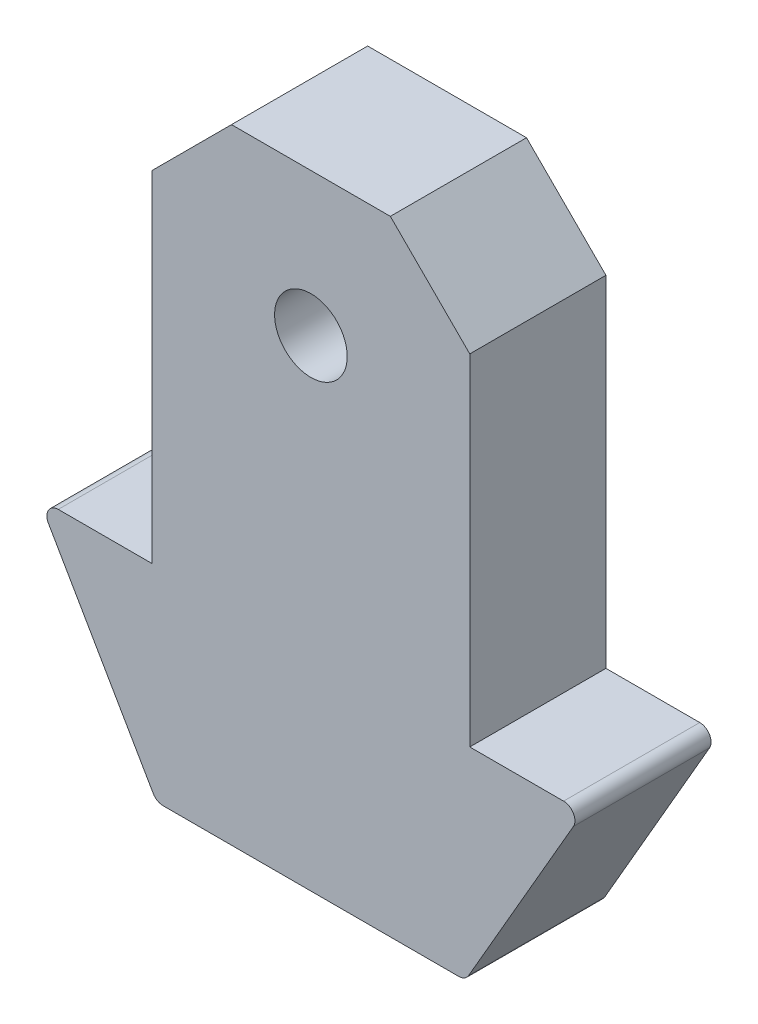
ISO-10303-21;
HEADER;
FILE_DESCRIPTION(('STEP AP214'),'2;1');
FILE_NAME('part.step','',(''),(''),'','','');
FILE_SCHEMA(('AUTOMOTIVE_DESIGN { 1 0 10303 214 1 1 1 1 }'));
ENDSEC;
DATA;
#1=APPLICATION_CONTEXT('core data for automotive mechanical design processes');
#2=APPLICATION_PROTOCOL_DEFINITION('international standard','automotive_design',2000,#1);
#3=PRODUCT_CONTEXT('',#1,'mechanical');
#4=PRODUCT('Part','Part','',(#3));
#5=PRODUCT_RELATED_PRODUCT_CATEGORY('part','',(#4));
#6=PRODUCT_DEFINITION_FORMATION('','',#4);
#7=PRODUCT_DEFINITION_CONTEXT('part definition',#1,'design');
#8=PRODUCT_DEFINITION('design','',#6,#7);
#9=PRODUCT_DEFINITION_SHAPE('','',#8);
#10=(LENGTH_UNIT() NAMED_UNIT(*) SI_UNIT(.MILLI.,.METRE.));
#11=(NAMED_UNIT(*) PLANE_ANGLE_UNIT() SI_UNIT($,.RADIAN.));
#12=(NAMED_UNIT(*) SI_UNIT($,.STERADIAN.) SOLID_ANGLE_UNIT());
#13=UNCERTAINTY_MEASURE_WITH_UNIT(LENGTH_MEASURE(1.E-05),#10,'distance_accuracy_value','');
#14=(GEOMETRIC_REPRESENTATION_CONTEXT(3) GLOBAL_UNCERTAINTY_ASSIGNED_CONTEXT((#13)) GLOBAL_UNIT_ASSIGNED_CONTEXT((#10,
#11,#12)) REPRESENTATION_CONTEXT('',''));
#15=CARTESIAN_POINT('',(0.,0.,0.));
#16=DIRECTION('',(0.,0.,1.));
#17=DIRECTION('',(1.,0.,0.));
#18=AXIS2_PLACEMENT_3D('',#15,#16,#17);
#19=CARTESIAN_POINT('',(7.,0.,3.));
#20=DIRECTION('',(-1.,0.,0.));
#21=DIRECTION('',(0.,-1.,0.));
#22=AXIS2_PLACEMENT_3D('',#19,#20,#21);
#23=PLANE('',#22);
#24=DIRECTION('',(0.,1.,0.));
#25=VECTOR('',#24,1.);
#26=CARTESIAN_POINT('',(7.,0.,-3.));
#27=LINE('',#26,#25);
#28=CARTESIAN_POINT('',(7.00000000000001,-18.5,-3.));
#29=VERTEX_POINT('',#28);
#30=CARTESIAN_POINT('',(7.,-3.5,-3.));
#31=VERTEX_POINT('',#30);
#32=EDGE_CURVE('E173',#29,#31,#27,.T.);
#33=ORIENTED_EDGE('',*,*,#32,.T.);
#34=DIRECTION('',(0.,0.,1.));
#35=VECTOR('',#34,1.);
#36=CARTESIAN_POINT('',(7.,-3.5,3.));
#37=LINE('',#36,#35);
#38=CARTESIAN_POINT('',(7.,-3.5,3.));
#39=VERTEX_POINT('',#38);
#40=EDGE_CURVE('E209',#31,#39,#37,.T.);
#41=ORIENTED_EDGE('',*,*,#40,.T.);
#42=DIRECTION('',(0.,1.,0.));
#43=VECTOR('',#42,1.);
#44=CARTESIAN_POINT('',(7.,0.,3.));
#45=LINE('',#44,#43);
#46=CARTESIAN_POINT('',(7.00000000000001,-18.5,3.));
#47=VERTEX_POINT('',#46);
#48=EDGE_CURVE('E193',#47,#39,#45,.T.);
#49=ORIENTED_EDGE('',*,*,#48,.F.);
#50=DIRECTION('',(0.,0.,-1.));
#51=VECTOR('',#50,1.);
#52=CARTESIAN_POINT('',(7.00000000000001,-18.5,3.));
#53=LINE('',#52,#51);
#54=EDGE_CURVE('E156',#47,#29,#53,.T.);
#55=ORIENTED_EDGE('',*,*,#54,.T.);
#56=EDGE_LOOP('',(#33,#41,#49,#55));
#57=FACE_BOUND('',#56,.T.);
#58=ADVANCED_FACE('F30',(#57),#23,.F.);
#59=CARTESIAN_POINT('',(-7.,0.,3.));
#60=DIRECTION('',(0.,-1.,0.));
#61=DIRECTION('',(1.,0.,0.));
#62=AXIS2_PLACEMENT_3D('',#59,#60,#61);
#63=PLANE('',#62);
#64=DIRECTION('',(-1.,0.,0.));
#65=VECTOR('',#64,1.);
#66=CARTESIAN_POINT('',(-7.,0.,-3.));
#67=LINE('',#66,#65);
#68=CARTESIAN_POINT('',(3.5,0.,-3.));
#69=VERTEX_POINT('',#68);
#70=CARTESIAN_POINT('',(-3.49999999999999,0.,-3.));
#71=VERTEX_POINT('',#70);
#72=EDGE_CURVE('E176',#69,#71,#67,.T.);
#73=ORIENTED_EDGE('',*,*,#72,.T.);
#74=DIRECTION('',(0.,0.,1.));
#75=VECTOR('',#74,1.);
#76=CARTESIAN_POINT('',(-3.49999999999999,0.,3.));
#77=LINE('',#76,#75);
#78=CARTESIAN_POINT('',(-3.5,0.,3.));
#79=VERTEX_POINT('',#78);
#80=EDGE_CURVE('E204',#71,#79,#77,.T.);
#81=ORIENTED_EDGE('',*,*,#80,.T.);
#82=DIRECTION('',(-1.,0.,0.));
#83=VECTOR('',#82,1.);
#84=CARTESIAN_POINT('',(-7.,0.,3.));
#85=LINE('',#84,#83);
#86=CARTESIAN_POINT('',(3.5,0.,3.));
#87=VERTEX_POINT('',#86);
#88=EDGE_CURVE('E145',#87,#79,#85,.T.);
#89=ORIENTED_EDGE('',*,*,#88,.F.);
#90=DIRECTION('',(0.,0.,-1.));
#91=VECTOR('',#90,1.);
#92=CARTESIAN_POINT('',(3.50000000000001,0.,3.));
#93=LINE('',#92,#91);
#94=EDGE_CURVE('E201',#87,#69,#93,.T.);
#95=ORIENTED_EDGE('',*,*,#94,.T.);
#96=EDGE_LOOP('',(#73,#81,#89,#95));
#97=FACE_BOUND('',#96,.T.);
#98=ADVANCED_FACE('F265',(#97),#63,.F.);
#99=CARTESIAN_POINT('',(-7.,-18.5,3.));
#100=DIRECTION('',(1.,0.,0.));
#101=DIRECTION('',(0.,0.,-1.));
#102=AXIS2_PLACEMENT_3D('',#99,#100,#101);
#103=PLANE('',#102);
#104=DIRECTION('',(0.,-1.,0.));
#105=VECTOR('',#104,1.);
#106=CARTESIAN_POINT('',(-7.,-18.5,3.));
#107=LINE('',#106,#105);
#108=CARTESIAN_POINT('',(-7.,-3.49999999999999,3.));
#109=VERTEX_POINT('',#108);
#110=CARTESIAN_POINT('',(-7.,-18.5,3.));
#111=VERTEX_POINT('',#110);
#112=EDGE_CURVE('E132',#109,#111,#107,.T.);
#113=ORIENTED_EDGE('',*,*,#112,.F.);
#114=DIRECTION('',(0.,0.,-1.));
#115=VECTOR('',#114,1.);
#116=CARTESIAN_POINT('',(-7.,-3.5,3.));
#117=LINE('',#116,#115);
#118=CARTESIAN_POINT('',(-7.,-3.5,-3.));
#119=VERTEX_POINT('',#118);
#120=EDGE_CURVE('E155',#109,#119,#117,.T.);
#121=ORIENTED_EDGE('',*,*,#120,.T.);
#122=DIRECTION('',(0.,-1.,0.));
#123=VECTOR('',#122,1.);
#124=CARTESIAN_POINT('',(-7.,-18.5,-3.));
#125=LINE('',#124,#123);
#126=CARTESIAN_POINT('',(-7.,-18.5,-3.));
#127=VERTEX_POINT('',#126);
#128=EDGE_CURVE('E151',#119,#127,#125,.T.);
#129=ORIENTED_EDGE('',*,*,#128,.T.);
#130=DIRECTION('',(0.,0.,-1.));
#131=VECTOR('',#130,1.);
#132=CARTESIAN_POINT('',(-7.,-18.5,3.));
#133=LINE('',#132,#131);
#134=EDGE_CURVE('E148',#111,#127,#133,.T.);
#135=ORIENTED_EDGE('',*,*,#134,.F.);
#136=EDGE_LOOP('',(#113,#121,#129,#135));
#137=FACE_BOUND('',#136,.T.);
#138=ADVANCED_FACE('F149',(#137),#103,.F.);
#139=CARTESIAN_POINT('',(-12.,-18.5,3.));
#140=DIRECTION('',(0.,-1.,0.));
#141=DIRECTION('',(0.,0.,-1.));
#142=AXIS2_PLACEMENT_3D('',#139,#140,#141);
#143=PLANE('',#142);
#144=DIRECTION('',(-1.,0.,0.));
#145=VECTOR('',#144,1.);
#146=CARTESIAN_POINT('',(-12.,-18.5,-3.));
#147=LINE('',#146,#145);
#148=CARTESIAN_POINT('',(-11.1339745962156,-18.5,-3.));
#149=VERTEX_POINT('',#148);
#150=EDGE_CURVE('E181',#127,#149,#147,.T.);
#151=ORIENTED_EDGE('',*,*,#150,.T.);
#152=DIRECTION('',(0.,0.,-1.));
#153=VECTOR('',#152,1.);
#154=CARTESIAN_POINT('',(-11.1339745962156,-18.5,3.));
#155=LINE('',#154,#153);
#156=CARTESIAN_POINT('',(-11.1339745962156,-18.5,3.));
#157=VERTEX_POINT('',#156);
#158=EDGE_CURVE('E160',#149,#157,#155,.F.);
#159=ORIENTED_EDGE('',*,*,#158,.T.);
#160=DIRECTION('',(-1.,0.,0.));
#161=VECTOR('',#160,1.);
#162=CARTESIAN_POINT('',(-12.,-18.5,3.));
#163=LINE('',#162,#161);
#164=EDGE_CURVE('E137',#111,#157,#163,.T.);
#165=ORIENTED_EDGE('',*,*,#164,.F.);
#166=ORIENTED_EDGE('',*,*,#134,.T.);
#167=EDGE_LOOP('',(#151,#159,#165,#166));
#168=FACE_BOUND('',#167,.T.);
#169=ADVANCED_FACE('F158',(#168),#143,.F.);
#170=CARTESIAN_POINT('',(-6.80384757729331,-27.5,3.));
#171=DIRECTION('',(0.866025403784436,0.500000000000004,0.));
#172=DIRECTION('',(-0.500000000000004,0.866025403784436,0.));
#173=AXIS2_PLACEMENT_3D('',#170,#171,#172);
#174=PLANE('',#173);
#175=DIRECTION('',(0.500000000000004,-0.866025403784436,0.));
#176=VECTOR('',#175,1.);
#177=CARTESIAN_POINT('',(-6.80384757729331,-27.5,-3.));
#178=LINE('',#177,#176);
#179=CARTESIAN_POINT('',(-11.5669872981078,-19.25,-3.));
#180=VERTEX_POINT('',#179);
#181=CARTESIAN_POINT('',(-6.94818514459072,-27.25,-3.));
#182=VERTEX_POINT('',#181);
#183=EDGE_CURVE('E183',#180,#182,#178,.T.);
#184=ORIENTED_EDGE('',*,*,#183,.T.);
#185=DIRECTION('',(0.,0.,-1.));
#186=VECTOR('',#185,1.);
#187=CARTESIAN_POINT('',(-6.94818514459072,-27.25,3.));
#188=LINE('',#187,#186);
#189=CARTESIAN_POINT('',(-6.94818514459072,-27.25,3.));
#190=VERTEX_POINT('',#189);
#191=EDGE_CURVE('E227',#182,#190,#188,.F.);
#192=ORIENTED_EDGE('',*,*,#191,.T.);
#193=DIRECTION('',(0.500000000000004,-0.866025403784436,0.));
#194=VECTOR('',#193,1.);
#195=CARTESIAN_POINT('',(-6.80384757729331,-27.5,3.));
#196=LINE('',#195,#194);
#197=CARTESIAN_POINT('',(-11.5669872981078,-19.25,3.));
#198=VERTEX_POINT('',#197);
#199=EDGE_CURVE('E161',#198,#190,#196,.T.);
#200=ORIENTED_EDGE('',*,*,#199,.F.);
#201=DIRECTION('',(0.,0.,-1.));
#202=VECTOR('',#201,1.);
#203=CARTESIAN_POINT('',(-11.5669872981078,-19.25,3.));
#204=LINE('',#203,#202);
#205=EDGE_CURVE('E224',#198,#180,#204,.T.);
#206=ORIENTED_EDGE('',*,*,#205,.T.);
#207=EDGE_LOOP('',(#184,#192,#200,#206));
#208=FACE_BOUND('',#207,.T.);
#209=ADVANCED_FACE('F324',(#208),#174,.F.);
#210=CARTESIAN_POINT('',(6.80384757729332,-27.5,3.));
#211=DIRECTION('',(0.,1.,0.));
#212=DIRECTION('',(0.,0.,1.));
#213=AXIS2_PLACEMENT_3D('',#210,#211,#212);
#214=PLANE('',#213);
#215=DIRECTION('',(1.,0.,0.));
#216=VECTOR('',#215,1.);
#217=CARTESIAN_POINT('',(6.80384757729332,-27.5,3.));
#218=LINE('',#217,#216);
#219=CARTESIAN_POINT('',(-6.5151724426985,-27.5,3.));
#220=VERTEX_POINT('',#219);
#221=CARTESIAN_POINT('',(6.51517244269851,-27.5,3.));
#222=VERTEX_POINT('',#221);
#223=EDGE_CURVE('E163',#220,#222,#218,.T.);
#224=ORIENTED_EDGE('',*,*,#223,.F.);
#225=DIRECTION('',(0.,0.,-1.));
#226=VECTOR('',#225,1.);
#227=CARTESIAN_POINT('',(-6.5151724426985,-27.5,3.));
#228=LINE('',#227,#226);
#229=CARTESIAN_POINT('',(-6.5151724426985,-27.5,-3.));
#230=VERTEX_POINT('',#229);
#231=EDGE_CURVE('E213',#220,#230,#228,.T.);
#232=ORIENTED_EDGE('',*,*,#231,.T.);
#233=DIRECTION('',(1.,0.,0.));
#234=VECTOR('',#233,1.);
#235=CARTESIAN_POINT('',(6.80384757729332,-27.5,-3.));
#236=LINE('',#235,#234);
#237=CARTESIAN_POINT('',(6.51517244269851,-27.5,-3.));
#238=VERTEX_POINT('',#237);
#239=EDGE_CURVE('E186',#230,#238,#236,.T.);
#240=ORIENTED_EDGE('',*,*,#239,.T.);
#241=DIRECTION('',(0.,0.,-1.));
#242=VECTOR('',#241,1.);
#243=CARTESIAN_POINT('',(6.51517244269851,-27.5,3.));
#244=LINE('',#243,#242);
#245=EDGE_CURVE('E211',#238,#222,#244,.F.);
#246=ORIENTED_EDGE('',*,*,#245,.T.);
#247=EDGE_LOOP('',(#224,#232,#240,#246));
#248=FACE_BOUND('',#247,.T.);
#249=ADVANCED_FACE('F320',(#248),#214,.F.);
#250=CARTESIAN_POINT('',(12.,-18.5,3.));
#251=DIRECTION('',(-0.866025403784436,0.500000000000004,0.));
#252=DIRECTION('',(-0.500000000000004,-0.866025403784436,0.));
#253=AXIS2_PLACEMENT_3D('',#250,#251,#252);
#254=PLANE('',#253);
#255=DIRECTION('',(0.500000000000004,0.866025403784436,0.));
#256=VECTOR('',#255,1.);
#257=CARTESIAN_POINT('',(12.,-18.5,3.));
#258=LINE('',#257,#256);
#259=CARTESIAN_POINT('',(6.94818514459072,-27.25,3.));
#260=VERTEX_POINT('',#259);
#261=CARTESIAN_POINT('',(11.5669872981078,-19.25,3.));
#262=VERTEX_POINT('',#261);
#263=EDGE_CURVE('E169',#260,#262,#258,.T.);
#264=ORIENTED_EDGE('',*,*,#263,.F.);
#265=DIRECTION('',(0.,0.,-1.));
#266=VECTOR('',#265,1.);
#267=CARTESIAN_POINT('',(6.94818514459072,-27.25,3.));
#268=LINE('',#267,#266);
#269=CARTESIAN_POINT('',(6.94818514459072,-27.25,-3.));
#270=VERTEX_POINT('',#269);
#271=EDGE_CURVE('E38',#260,#270,#268,.T.);
#272=ORIENTED_EDGE('',*,*,#271,.T.);
#273=DIRECTION('',(0.500000000000004,0.866025403784436,0.));
#274=VECTOR('',#273,1.);
#275=CARTESIAN_POINT('',(12.,-18.5,-3.));
#276=LINE('',#275,#274);
#277=CARTESIAN_POINT('',(11.5669872981078,-19.25,-3.));
#278=VERTEX_POINT('',#277);
#279=EDGE_CURVE('E189',#270,#278,#276,.T.);
#280=ORIENTED_EDGE('',*,*,#279,.T.);
#281=DIRECTION('',(0.,0.,-1.));
#282=VECTOR('',#281,1.);
#283=CARTESIAN_POINT('',(11.5669872981078,-19.25,3.));
#284=LINE('',#283,#282);
#285=EDGE_CURVE('E53',#278,#262,#284,.F.);
#286=ORIENTED_EDGE('',*,*,#285,.T.);
#287=EDGE_LOOP('',(#264,#272,#280,#286));
#288=FACE_BOUND('',#287,.T.);
#289=ADVANCED_FACE('F240',(#288),#254,.F.);
#290=CARTESIAN_POINT('',(7.00000000000001,-18.5,3.));
#291=DIRECTION('',(0.,-1.,0.));
#292=DIRECTION('',(1.,0.,0.));
#293=AXIS2_PLACEMENT_3D('',#290,#291,#292);
#294=PLANE('',#293);
#295=DIRECTION('',(-1.,0.,0.));
#296=VECTOR('',#295,1.);
#297=CARTESIAN_POINT('',(7.00000000000001,-18.5,3.));
#298=LINE('',#297,#296);
#299=CARTESIAN_POINT('',(11.1339745962156,-18.5,3.));
#300=VERTEX_POINT('',#299);
#301=EDGE_CURVE('E171',#300,#47,#298,.T.);
#302=ORIENTED_EDGE('',*,*,#301,.F.);
#303=DIRECTION('',(0.,0.,-1.));
#304=VECTOR('',#303,1.);
#305=CARTESIAN_POINT('',(11.1339745962156,-18.5,3.));
#306=LINE('',#305,#304);
#307=CARTESIAN_POINT('',(11.1339745962156,-18.5,-3.));
#308=VERTEX_POINT('',#307);
#309=EDGE_CURVE('E11',#300,#308,#306,.T.);
#310=ORIENTED_EDGE('',*,*,#309,.T.);
#311=DIRECTION('',(-1.,0.,0.));
#312=VECTOR('',#311,1.);
#313=CARTESIAN_POINT('',(7.00000000000001,-18.5,-3.));
#314=LINE('',#313,#312);
#315=EDGE_CURVE('E191',#308,#29,#314,.T.);
#316=ORIENTED_EDGE('',*,*,#315,.T.);
#317=ORIENTED_EDGE('',*,*,#54,.F.);
#318=EDGE_LOOP('',(#302,#310,#316,#317));
#319=FACE_BOUND('',#318,.T.);
#320=ADVANCED_FACE('F251',(#319),#294,.F.);
#321=CARTESIAN_POINT('',(7.00000000000001,-18.5,3.));
#322=DIRECTION('',(0.,0.,1.));
#323=DIRECTION('',(1.,0.,0.));
#324=AXIS2_PLACEMENT_3D('',#321,#322,#323);
#325=PLANE('',#324);
#326=CARTESIAN_POINT('',(0.,-6.3,3.));
#327=DIRECTION('',(0.,0.,1.));
#328=DIRECTION('',(1.,0.,0.));
#329=AXIS2_PLACEMENT_3D('',#326,#327,#328);
#330=CIRCLE('',#329,1.6);
#331=CARTESIAN_POINT('',(1.6,-6.3,3.));
#332=VERTEX_POINT('',#331);
#333=EDGE_CURVE('E270',#332,#332,#330,.T.);
#334=ORIENTED_EDGE('',*,*,#333,.F.);
#335=EDGE_LOOP('',(#334));
#336=FACE_BOUND('',#335,.T.);
#337=ORIENTED_EDGE('',*,*,#199,.T.);
#338=CARTESIAN_POINT('',(-6.5151724426985,-27.,3.));
#339=DIRECTION('',(0.,0.,1.));
#340=DIRECTION('',(1.,0.,0.));
#341=AXIS2_PLACEMENT_3D('',#338,#339,#340);
#342=CIRCLE('',#341,0.5);
#343=EDGE_CURVE('E234',#190,#220,#342,.T.);
#344=ORIENTED_EDGE('',*,*,#343,.T.);
#345=ORIENTED_EDGE('',*,*,#223,.T.);
#346=CARTESIAN_POINT('',(6.51517244269851,-27.,3.));
#347=DIRECTION('',(0.,0.,1.));
#348=DIRECTION('',(1.,0.,0.));
#349=AXIS2_PLACEMENT_3D('',#346,#347,#348);
#350=CIRCLE('',#349,0.5);
#351=EDGE_CURVE('E230',#222,#260,#350,.T.);
#352=ORIENTED_EDGE('',*,*,#351,.T.);
#353=ORIENTED_EDGE('',*,*,#263,.T.);
#354=CARTESIAN_POINT('',(11.1339745962156,-19.,3.));
#355=DIRECTION('',(0.,0.,1.));
#356=DIRECTION('',(1.,0.,0.));
#357=AXIS2_PLACEMENT_3D('',#354,#355,#356);
#358=CIRCLE('',#357,0.5);
#359=EDGE_CURVE('E45',#262,#300,#358,.T.);
#360=ORIENTED_EDGE('',*,*,#359,.T.);
#361=ORIENTED_EDGE('',*,*,#301,.T.);
#362=ORIENTED_EDGE('',*,*,#48,.T.);
#363=DIRECTION('',(0.707106781186546,-0.707106781186549,0.));
#364=VECTOR('',#363,1.);
#365=CARTESIAN_POINT('',(14.5,-11.,3.));
#366=LINE('',#365,#364);
#367=EDGE_CURVE('E206',#39,#87,#366,.F.);
#368=ORIENTED_EDGE('',*,*,#367,.T.);
#369=ORIENTED_EDGE('',*,*,#88,.T.);
#370=DIRECTION('',(0.707106781186549,0.707106781186547,0.));
#371=VECTOR('',#370,1.);
#372=CARTESIAN_POINT('',(-7.49999999999998,-3.99999999999997,3.));
#373=LINE('',#372,#371);
#374=EDGE_CURVE('E141',#79,#109,#373,.F.);
#375=ORIENTED_EDGE('',*,*,#374,.T.);
#376=ORIENTED_EDGE('',*,*,#112,.T.);
#377=ORIENTED_EDGE('',*,*,#164,.T.);
#378=CARTESIAN_POINT('',(-11.1339745962156,-19.,3.));
#379=DIRECTION('',(0.,0.,1.));
#380=DIRECTION('',(1.,0.,0.));
#381=AXIS2_PLACEMENT_3D('',#378,#379,#380);
#382=CIRCLE('',#381,0.5);
#383=EDGE_CURVE('E232',#157,#198,#382,.T.);
#384=ORIENTED_EDGE('',*,*,#383,.T.);
#385=EDGE_LOOP('',(#337,#344,#345,#352,#353,#360,#361,#362,#368,#369,#375,#376,#377,#384));
#386=FACE_BOUND('',#385,.T.);
#387=ADVANCED_FACE('F135',(#336,#386),#325,.T.);
#388=CARTESIAN_POINT('',(7.00000000000001,-18.5,-3.));
#389=DIRECTION('',(0.,0.,1.));
#390=DIRECTION('',(1.,0.,0.));
#391=AXIS2_PLACEMENT_3D('',#388,#389,#390);
#392=PLANE('',#391);
#393=CARTESIAN_POINT('',(0.,-6.3,-3.));
#394=DIRECTION('',(0.,0.,1.));
#395=DIRECTION('',(1.,0.,0.));
#396=AXIS2_PLACEMENT_3D('',#393,#394,#395);
#397=CIRCLE('',#396,1.6);
#398=CARTESIAN_POINT('',(1.6,-6.3,-3.));
#399=VERTEX_POINT('',#398);
#400=EDGE_CURVE('E177',#399,#399,#397,.T.);
#401=ORIENTED_EDGE('',*,*,#400,.T.);
#402=EDGE_LOOP('',(#401));
#403=FACE_BOUND('',#402,.T.);
#404=ORIENTED_EDGE('',*,*,#239,.F.);
#405=CARTESIAN_POINT('',(-6.5151724426985,-27.,-3.));
#406=DIRECTION('',(0.,0.,1.));
#407=DIRECTION('',(1.,0.,0.));
#408=AXIS2_PLACEMENT_3D('',#405,#406,#407);
#409=CIRCLE('',#408,0.5);
#410=EDGE_CURVE('E222',#230,#182,#409,.F.);
#411=ORIENTED_EDGE('',*,*,#410,.T.);
#412=ORIENTED_EDGE('',*,*,#183,.F.);
#413=CARTESIAN_POINT('',(-11.1339745962156,-19.,-3.));
#414=DIRECTION('',(0.,0.,1.));
#415=DIRECTION('',(1.,0.,0.));
#416=AXIS2_PLACEMENT_3D('',#413,#414,#415);
#417=CIRCLE('',#416,0.5);
#418=EDGE_CURVE('E220',#180,#149,#417,.F.);
#419=ORIENTED_EDGE('',*,*,#418,.T.);
#420=ORIENTED_EDGE('',*,*,#150,.F.);
#421=ORIENTED_EDGE('',*,*,#128,.F.);
#422=DIRECTION('',(-0.707106781186549,-0.707106781186547,0.));
#423=VECTOR('',#422,1.);
#424=CARTESIAN_POINT('',(-7.,-3.5,-3.));
#425=LINE('',#424,#423);
#426=EDGE_CURVE('E199',#119,#71,#425,.F.);
#427=ORIENTED_EDGE('',*,*,#426,.T.);
#428=ORIENTED_EDGE('',*,*,#72,.F.);
#429=DIRECTION('',(-0.707106781186546,0.707106781186549,0.));
#430=VECTOR('',#429,1.);
#431=CARTESIAN_POINT('',(3.50000000000001,0.,-3.));
#432=LINE('',#431,#430);
#433=EDGE_CURVE('E197',#69,#31,#432,.F.);
#434=ORIENTED_EDGE('',*,*,#433,.T.);
#435=ORIENTED_EDGE('',*,*,#32,.F.);
#436=ORIENTED_EDGE('',*,*,#315,.F.);
#437=CARTESIAN_POINT('',(11.1339745962156,-19.,-3.));
#438=DIRECTION('',(0.,0.,1.));
#439=DIRECTION('',(1.,0.,0.));
#440=AXIS2_PLACEMENT_3D('',#437,#438,#439);
#441=CIRCLE('',#440,0.5);
#442=EDGE_CURVE('E216',#308,#278,#441,.F.);
#443=ORIENTED_EDGE('',*,*,#442,.T.);
#444=ORIENTED_EDGE('',*,*,#279,.F.);
#445=CARTESIAN_POINT('',(6.51517244269851,-27.,-3.));
#446=DIRECTION('',(0.,0.,1.));
#447=DIRECTION('',(1.,0.,0.));
#448=AXIS2_PLACEMENT_3D('',#445,#446,#447);
#449=CIRCLE('',#448,0.5);
#450=EDGE_CURVE('E218',#270,#238,#449,.F.);
#451=ORIENTED_EDGE('',*,*,#450,.T.);
#452=EDGE_LOOP('',(#404,#411,#412,#419,#420,#421,#427,#428,#434,#435,#436,#443,#444,#451));
#453=FACE_BOUND('',#452,.T.);
#454=ADVANCED_FACE('F245',(#403,#453),#392,.F.);
#455=CARTESIAN_POINT('',(0.,-6.3,-3.));
#456=DIRECTION('',(0.,0.,1.));
#457=DIRECTION('',(1.,0.,0.));
#458=AXIS2_PLACEMENT_3D('',#455,#456,#457);
#459=CYLINDRICAL_SURFACE('',#458,1.6);
#460=ORIENTED_EDGE('',*,*,#400,.F.);
#461=EDGE_LOOP('',(#460));
#462=FACE_BOUND('',#461,.T.);
#463=ORIENTED_EDGE('',*,*,#333,.T.);
#464=EDGE_LOOP('',(#463));
#465=FACE_BOUND('',#464,.T.);
#466=ADVANCED_FACE('F277',(#462,#465),#459,.F.);
#467=CARTESIAN_POINT('',(-7.,-3.5,3.));
#468=DIRECTION('',(0.707106781186547,-0.707106781186549,0.));
#469=DIRECTION('',(0.707106781186549,0.707106781186547,0.));
#470=AXIS2_PLACEMENT_3D('',#467,#468,#469);
#471=PLANE('',#470);
#472=ORIENTED_EDGE('',*,*,#374,.F.);
#473=ORIENTED_EDGE('',*,*,#80,.F.);
#474=ORIENTED_EDGE('',*,*,#426,.F.);
#475=ORIENTED_EDGE('',*,*,#120,.F.);
#476=EDGE_LOOP('',(#472,#473,#474,#475));
#477=FACE_BOUND('',#476,.T.);
#478=ADVANCED_FACE('F268',(#477),#471,.F.);
#479=CARTESIAN_POINT('',(3.50000000000001,0.,3.));
#480=DIRECTION('',(-0.707106781186549,-0.707106781186546,0.));
#481=DIRECTION('',(0.707106781186546,-0.707106781186549,0.));
#482=AXIS2_PLACEMENT_3D('',#479,#480,#481);
#483=PLANE('',#482);
#484=ORIENTED_EDGE('',*,*,#367,.F.);
#485=ORIENTED_EDGE('',*,*,#40,.F.);
#486=ORIENTED_EDGE('',*,*,#433,.F.);
#487=ORIENTED_EDGE('',*,*,#94,.F.);
#488=EDGE_LOOP('',(#484,#485,#486,#487));
#489=FACE_BOUND('',#488,.T.);
#490=ADVANCED_FACE('F262',(#489),#483,.F.);
#491=CARTESIAN_POINT('',(-6.5151724426985,-27.,3.));
#492=DIRECTION('',(0.,0.,-1.));
#493=DIRECTION('',(-1.,0.,0.));
#494=AXIS2_PLACEMENT_3D('',#491,#492,#493);
#495=CYLINDRICAL_SURFACE('',#494,0.5);
#496=ORIENTED_EDGE('',*,*,#343,.F.);
#497=ORIENTED_EDGE('',*,*,#191,.F.);
#498=ORIENTED_EDGE('',*,*,#410,.F.);
#499=ORIENTED_EDGE('',*,*,#231,.F.);
#500=EDGE_LOOP('',(#496,#497,#498,#499));
#501=FACE_BOUND('',#500,.T.);
#502=ADVANCED_FACE('F303',(#501),#495,.T.);
#503=CARTESIAN_POINT('',(-11.1339745962156,-19.,3.));
#504=DIRECTION('',(0.,0.,-1.));
#505=DIRECTION('',(-1.,0.,0.));
#506=AXIS2_PLACEMENT_3D('',#503,#504,#505);
#507=CYLINDRICAL_SURFACE('',#506,0.5);
#508=ORIENTED_EDGE('',*,*,#383,.F.);
#509=ORIENTED_EDGE('',*,*,#158,.F.);
#510=ORIENTED_EDGE('',*,*,#418,.F.);
#511=ORIENTED_EDGE('',*,*,#205,.F.);
#512=EDGE_LOOP('',(#508,#509,#510,#511));
#513=FACE_BOUND('',#512,.T.);
#514=ADVANCED_FACE('F306',(#513),#507,.T.);
#515=CARTESIAN_POINT('',(6.51517244269851,-27.,3.));
#516=DIRECTION('',(0.,0.,-1.));
#517=DIRECTION('',(-1.,0.,0.));
#518=AXIS2_PLACEMENT_3D('',#515,#516,#517);
#519=CYLINDRICAL_SURFACE('',#518,0.5);
#520=ORIENTED_EDGE('',*,*,#351,.F.);
#521=ORIENTED_EDGE('',*,*,#245,.F.);
#522=ORIENTED_EDGE('',*,*,#450,.F.);
#523=ORIENTED_EDGE('',*,*,#271,.F.);
#524=EDGE_LOOP('',(#520,#521,#522,#523));
#525=FACE_BOUND('',#524,.T.);
#526=ADVANCED_FACE('F309',(#525),#519,.T.);
#527=CARTESIAN_POINT('',(11.1339745962156,-19.,3.));
#528=DIRECTION('',(0.,0.,-1.));
#529=DIRECTION('',(-1.,0.,0.));
#530=AXIS2_PLACEMENT_3D('',#527,#528,#529);
#531=CYLINDRICAL_SURFACE('',#530,0.5);
#532=ORIENTED_EDGE('',*,*,#359,.F.);
#533=ORIENTED_EDGE('',*,*,#285,.F.);
#534=ORIENTED_EDGE('',*,*,#442,.F.);
#535=ORIENTED_EDGE('',*,*,#309,.F.);
#536=EDGE_LOOP('',(#532,#533,#534,#535));
#537=FACE_BOUND('',#536,.T.);
#538=ADVANCED_FACE('F32',(#537),#531,.T.);
#539=CLOSED_SHELL('',(#58,#98,#138,#169,#209,#249,#289,#320,#387,#454,#466,#478,#490,#502,#514,
#526,#538));
#540=MANIFOLD_SOLID_BREP('B2',#539);
#541=ADVANCED_BREP_SHAPE_REPRESENTATION('',(#18,#540),#14);
#542=SHAPE_DEFINITION_REPRESENTATION(#9,#541);
ENDSEC;
END-ISO-10303-21;
